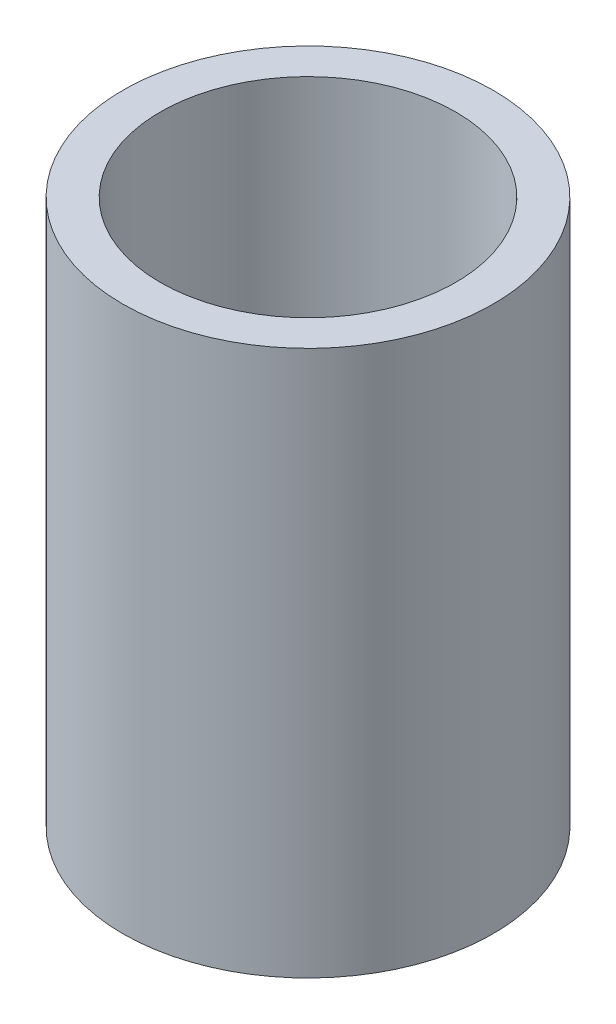
ISO-10303-21;
HEADER;
FILE_DESCRIPTION(('STEP AP214'),'2;1');
FILE_NAME('part.step','',(''),(''),'','','');
FILE_SCHEMA(('AUTOMOTIVE_DESIGN { 1 0 10303 214 1 1 1 1 }'));
ENDSEC;
DATA;
#1=APPLICATION_CONTEXT('core data for automotive mechanical design processes');
#2=APPLICATION_PROTOCOL_DEFINITION('international standard','automotive_design',2000,#1);
#3=PRODUCT_CONTEXT('',#1,'mechanical');
#4=PRODUCT('Part','Part','',(#3));
#5=PRODUCT_RELATED_PRODUCT_CATEGORY('part','',(#4));
#6=PRODUCT_DEFINITION_FORMATION('','',#4);
#7=PRODUCT_DEFINITION_CONTEXT('part definition',#1,'design');
#8=PRODUCT_DEFINITION('design','',#6,#7);
#9=PRODUCT_DEFINITION_SHAPE('','',#8);
#10=(LENGTH_UNIT() NAMED_UNIT(*) SI_UNIT(.MILLI.,.METRE.));
#11=(NAMED_UNIT(*) PLANE_ANGLE_UNIT() SI_UNIT($,.RADIAN.));
#12=(NAMED_UNIT(*) SI_UNIT($,.STERADIAN.) SOLID_ANGLE_UNIT());
#13=UNCERTAINTY_MEASURE_WITH_UNIT(LENGTH_MEASURE(1.E-05),#10,'distance_accuracy_value','');
#14=(GEOMETRIC_REPRESENTATION_CONTEXT(3) GLOBAL_UNCERTAINTY_ASSIGNED_CONTEXT((#13)) GLOBAL_UNIT_ASSIGNED_CONTEXT((#10,
#11,#12)) REPRESENTATION_CONTEXT('',''));
#15=CARTESIAN_POINT('',(0.,0.,0.));
#16=DIRECTION('',(0.,0.,1.));
#17=DIRECTION('',(1.,0.,0.));
#18=AXIS2_PLACEMENT_3D('',#15,#16,#17);
#19=CARTESIAN_POINT('',(0.,80.9711094086779,0.));
#20=DIRECTION('',(0.,-1.,0.));
#21=DIRECTION('',(0.,0.,-1.));
#22=AXIS2_PLACEMENT_3D('',#19,#20,#21);
#23=CYLINDRICAL_SURFACE('',#22,27.5);
#24=CARTESIAN_POINT('',(0.,80.9711094086779,0.));
#25=DIRECTION('',(0.,1.,0.));
#26=DIRECTION('',(0.,0.,1.));
#27=AXIS2_PLACEMENT_3D('',#24,#25,#26);
#28=CIRCLE('',#27,27.5);
#29=CARTESIAN_POINT('',(0.,80.9711094086779,27.5));
#30=VERTEX_POINT('',#29);
#31=EDGE_CURVE('E10',#30,#30,#28,.T.);
#32=ORIENTED_EDGE('',*,*,#31,.F.);
#33=EDGE_LOOP('',(#32));
#34=FACE_BOUND('',#33,.T.);
#35=CARTESIAN_POINT('',(0.,0.,0.));
#36=DIRECTION('',(0.,1.,0.));
#37=DIRECTION('',(0.,0.,1.));
#38=AXIS2_PLACEMENT_3D('',#35,#36,#37);
#39=CIRCLE('',#38,27.5);
#40=CARTESIAN_POINT('',(0.,0.,27.5));
#41=VERTEX_POINT('',#40);
#42=EDGE_CURVE('E37',#41,#41,#39,.T.);
#43=ORIENTED_EDGE('',*,*,#42,.T.);
#44=EDGE_LOOP('',(#43));
#45=FACE_BOUND('',#44,.T.);
#46=ADVANCED_FACE('F40',(#34,#45),#23,.T.);
#47=CARTESIAN_POINT('',(0.,80.9711094086779,0.));
#48=DIRECTION('',(0.,1.,0.));
#49=DIRECTION('',(0.,0.,1.));
#50=AXIS2_PLACEMENT_3D('',#47,#48,#49);
#51=PLANE('',#50);
#52=CARTESIAN_POINT('',(0.,80.9711094086779,0.));
#53=DIRECTION('',(0.,1.,0.));
#54=DIRECTION('',(0.,0.,1.));
#55=AXIS2_PLACEMENT_3D('',#52,#53,#54);
#56=CIRCLE('',#55,21.9323982519352);
#57=CARTESIAN_POINT('',(0.,80.9711094086779,21.9323982519352));
#58=VERTEX_POINT('',#57);
#59=EDGE_CURVE('E50',#58,#58,#56,.T.);
#60=ORIENTED_EDGE('',*,*,#59,.F.);
#61=EDGE_LOOP('',(#60));
#62=FACE_BOUND('',#61,.T.);
#63=ORIENTED_EDGE('',*,*,#31,.T.);
#64=EDGE_LOOP('',(#63));
#65=FACE_BOUND('',#64,.T.);
#66=ADVANCED_FACE('F59',(#62,#65),#51,.T.);
#67=CARTESIAN_POINT('',(0.,0.,0.));
#68=DIRECTION('',(0.,1.,0.));
#69=DIRECTION('',(0.,0.,1.));
#70=AXIS2_PLACEMENT_3D('',#67,#68,#69);
#71=PLANE('',#70);
#72=CARTESIAN_POINT('',(0.,0.,0.));
#73=DIRECTION('',(0.,1.,0.));
#74=DIRECTION('',(0.,0.,1.));
#75=AXIS2_PLACEMENT_3D('',#72,#73,#74);
#76=CIRCLE('',#75,21.9323982519352);
#77=CARTESIAN_POINT('',(0.,0.,21.9323982519352));
#78=VERTEX_POINT('',#77);
#79=EDGE_CURVE('E47',#78,#78,#76,.T.);
#80=ORIENTED_EDGE('',*,*,#79,.T.);
#81=EDGE_LOOP('',(#80));
#82=FACE_BOUND('',#81,.T.);
#83=ORIENTED_EDGE('',*,*,#42,.F.);
#84=EDGE_LOOP('',(#83));
#85=FACE_BOUND('',#84,.T.);
#86=ADVANCED_FACE('F58',(#82,#85),#71,.F.);
#87=CARTESIAN_POINT('',(0.,80.9711094086779,0.));
#88=DIRECTION('',(0.,-1.,0.));
#89=DIRECTION('',(0.,0.,-1.));
#90=AXIS2_PLACEMENT_3D('',#87,#88,#89);
#91=CYLINDRICAL_SURFACE('',#90,21.9323982519352);
#92=ORIENTED_EDGE('',*,*,#59,.T.);
#93=EDGE_LOOP('',(#92));
#94=FACE_BOUND('',#93,.T.);
#95=ORIENTED_EDGE('',*,*,#79,.F.);
#96=EDGE_LOOP('',(#95));
#97=FACE_BOUND('',#96,.T.);
#98=ADVANCED_FACE('F54',(#94,#97),#91,.F.);
#99=CLOSED_SHELL('',(#46,#66,#86,#98));
#100=MANIFOLD_SOLID_BREP('B2',#99);
#101=ADVANCED_BREP_SHAPE_REPRESENTATION('',(#18,#100),#14);
#102=SHAPE_DEFINITION_REPRESENTATION(#9,#101);
ENDSEC;
END-ISO-10303-21;
